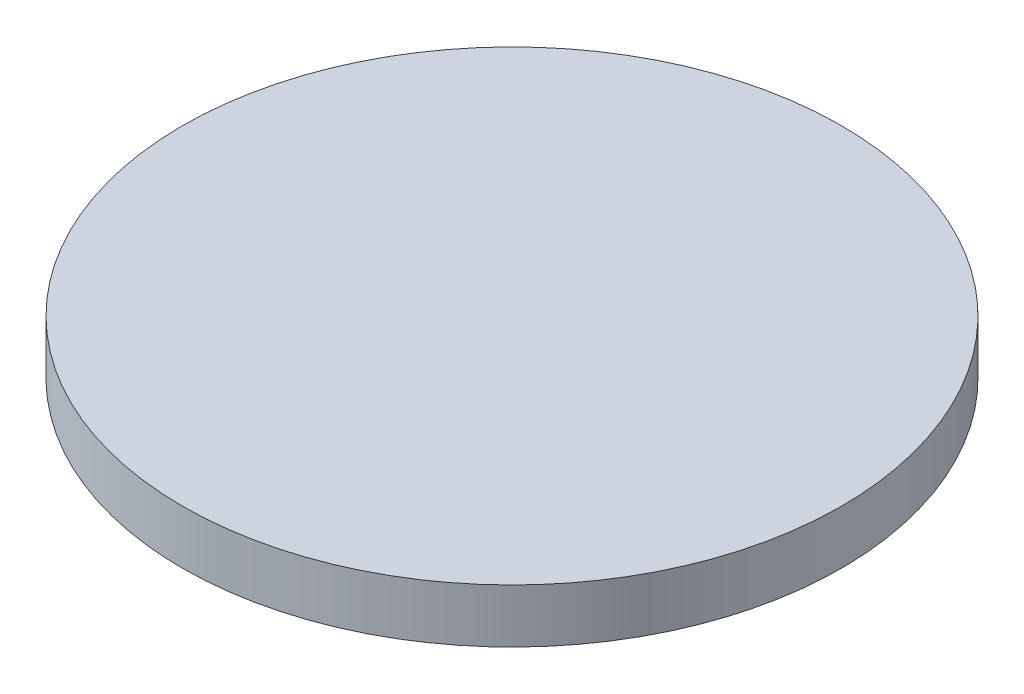
ISO-10303-21;
HEADER;
FILE_DESCRIPTION(('STEP AP214'),'2;1');
FILE_NAME('part.step','',(''),(''),'','','');
FILE_SCHEMA(('AUTOMOTIVE_DESIGN { 1 0 10303 214 1 1 1 1 }'));
ENDSEC;
DATA;
#1=APPLICATION_CONTEXT('core data for automotive mechanical design processes');
#2=APPLICATION_PROTOCOL_DEFINITION('international standard','automotive_design',2000,#1);
#3=PRODUCT_CONTEXT('',#1,'mechanical');
#4=PRODUCT('Part','Part','',(#3));
#5=PRODUCT_RELATED_PRODUCT_CATEGORY('part','',(#4));
#6=PRODUCT_DEFINITION_FORMATION('','',#4);
#7=PRODUCT_DEFINITION_CONTEXT('part definition',#1,'design');
#8=PRODUCT_DEFINITION('design','',#6,#7);
#9=PRODUCT_DEFINITION_SHAPE('','',#8);
#10=(LENGTH_UNIT() NAMED_UNIT(*) SI_UNIT(.MILLI.,.METRE.));
#11=(NAMED_UNIT(*) PLANE_ANGLE_UNIT() SI_UNIT($,.RADIAN.));
#12=(NAMED_UNIT(*) SI_UNIT($,.STERADIAN.) SOLID_ANGLE_UNIT());
#13=UNCERTAINTY_MEASURE_WITH_UNIT(LENGTH_MEASURE(1.E-05),#10,'distance_accuracy_value','');
#14=(GEOMETRIC_REPRESENTATION_CONTEXT(3) GLOBAL_UNCERTAINTY_ASSIGNED_CONTEXT((#13)) GLOBAL_UNIT_ASSIGNED_CONTEXT((#10,
#11,#12)) REPRESENTATION_CONTEXT('',''));
#15=CARTESIAN_POINT('',(0.,0.,0.));
#16=DIRECTION('',(0.,0.,1.));
#17=DIRECTION('',(1.,0.,0.));
#18=AXIS2_PLACEMENT_3D('',#15,#16,#17);
#19=CARTESIAN_POINT('',(24.4976354172611,87.9395406480673,128.323997251865));
#20=CARTESIAN_POINT('',(24.9591019712657,87.9395406480672,128.323997251865));
#21=CARTESIAN_POINT('',(25.8820350792749,87.9395406480672,128.233096274852));
#22=CARTESIAN_POINT('',(27.2132330386579,87.9395406480672,127.829281788648));
#23=CARTESIAN_POINT('',(28.4400721043752,87.9395406480672,127.173522646003));
#24=CARTESIAN_POINT('',(29.5154055391508,87.9395406480672,126.291019303014));
#25=CARTESIAN_POINT('',(30.39790888214,87.9395406480672,125.215685868238));
#26=CARTESIAN_POINT('',(31.0536680247854,87.9395406480672,123.988846802521));
#27=CARTESIAN_POINT('',(31.4574825109891,87.9395406480672,122.657648843138));
#28=CARTESIAN_POINT('',(31.593833976508,87.9395406480672,121.273249181124));
#29=CARTESIAN_POINT('',(31.4574825109891,87.9395406480672,119.88884951911));
#30=CARTESIAN_POINT('',(31.0536680247854,87.9395406480672,118.557651559727));
#31=CARTESIAN_POINT('',(30.39790888214,87.9395406480672,117.33081249401));
#32=CARTESIAN_POINT('',(29.5154055391508,87.9395406480672,116.255479059234));
#33=CARTESIAN_POINT('',(28.4400721043752,87.9395406480672,115.372975716245));
#34=CARTESIAN_POINT('',(27.2132330386579,87.9395406480672,114.7172165736));
#35=CARTESIAN_POINT('',(25.8820350792749,87.9395406480672,114.313402087396));
#36=CARTESIAN_POINT('',(24.4976354172611,87.9395406480672,114.177050621877));
#37=CARTESIAN_POINT('',(23.1132357552472,87.9395406480672,114.313402087396));
#38=CARTESIAN_POINT('',(21.7820377958642,87.9395406480672,114.7172165736));
#39=CARTESIAN_POINT('',(20.5551987301469,87.9395406480672,115.372975716245));
#40=CARTESIAN_POINT('',(19.4798652953713,87.9395406480672,116.255479059234));
#41=CARTESIAN_POINT('',(18.5973619523822,87.9395406480672,117.33081249401));
#42=CARTESIAN_POINT('',(17.9416028097367,87.9395406480672,118.557651559727));
#43=CARTESIAN_POINT('',(17.5377883235331,87.9395406480672,119.88884951911));
#44=CARTESIAN_POINT('',(17.4014368580141,87.9395406480672,121.273249181124));
#45=CARTESIAN_POINT('',(17.5377883235331,87.9395406480672,122.657648843138));
#46=CARTESIAN_POINT('',(17.9416028097368,87.9395406480672,123.988846802521));
#47=CARTESIAN_POINT('',(18.5973619523822,87.9395406480672,125.215685868238));
#48=CARTESIAN_POINT('',(19.4798652953714,87.9395406480672,126.291019303014));
#49=CARTESIAN_POINT('',(20.5551987301469,87.9395406480672,127.173522646003));
#50=CARTESIAN_POINT('',(21.7820377958642,87.9395406480672,127.829281788648));
#51=CARTESIAN_POINT('',(23.1132357552472,87.9395406480672,128.233096274852));
#52=CARTESIAN_POINT('',(24.0361688632565,87.9395406480673,128.323997251865));
#53=CARTESIAN_POINT('',(24.4976354172611,87.9395406480673,128.323997251865));
#54=B_SPLINE_CURVE_WITH_KNOTS('',3,(#19,#20,#21,#22,#23,#24,#25,#26,#27,#28,#29,#30,#31,#32,#33,
#34,#35,#36,#37,#38,#39,#40,#41,#42,#43,#44,#45,#46,#47,#48,#49,#50,#51,#52,#53),.UNSPECIFIED.,
.T.,.F.,(4,1,1,1,1,1,1,1,1,1,1,1,1,1,1,1,1,1,1,1,1,1,1,1,1,1,1,1,1,1,1,1,4),(0.,0.03125,0.0625,
0.09375,0.125,0.15625,0.1875,0.21875,0.25,0.28125,0.3125,0.34375,0.375,0.40625,0.4375,0.46875,
0.5,0.53125,0.5625,0.59375,0.625,0.65625,0.6875,0.71875,0.75,0.78125,0.8125,0.84375,0.875,
0.90625,0.9375,0.96875,1.),.UNSPECIFIED.);
#55=DIRECTION('',(0.,1.,0.));
#56=VECTOR('',#55,1.);
#57=SURFACE_OF_LINEAR_EXTRUSION('',#54,#56);
#58=CARTESIAN_POINT('',(24.4976354172611,87.9395406480672,128.323997251865));
#59=CARTESIAN_POINT('',(24.9591019712657,87.9395406480672,128.323997251865));
#60=CARTESIAN_POINT('',(25.8820350792749,87.9395406480672,128.233096274852));
#61=CARTESIAN_POINT('',(27.2132330386579,87.9395406480672,127.829281788648));
#62=CARTESIAN_POINT('',(28.4400721043752,87.9395406480672,127.173522646003));
#63=CARTESIAN_POINT('',(29.5154055391508,87.9395406480672,126.291019303014));
#64=CARTESIAN_POINT('',(30.39790888214,87.9395406480672,125.215685868238));
#65=CARTESIAN_POINT('',(31.0536680247854,87.9395406480672,123.988846802521));
#66=CARTESIAN_POINT('',(31.4574825109891,87.9395406480672,122.657648843138));
#67=CARTESIAN_POINT('',(31.593833976508,87.9395406480672,121.273249181124));
#68=CARTESIAN_POINT('',(31.4574825109891,87.9395406480672,119.88884951911));
#69=CARTESIAN_POINT('',(31.0536680247854,87.9395406480672,118.557651559727));
#70=CARTESIAN_POINT('',(30.39790888214,87.9395406480672,117.33081249401));
#71=CARTESIAN_POINT('',(29.5154055391508,87.9395406480672,116.255479059234));
#72=CARTESIAN_POINT('',(28.4400721043752,87.9395406480672,115.372975716245));
#73=CARTESIAN_POINT('',(27.2132330386579,87.9395406480672,114.7172165736));
#74=CARTESIAN_POINT('',(25.8820350792749,87.9395406480672,114.313402087396));
#75=CARTESIAN_POINT('',(24.4976354172611,87.9395406480672,114.177050621877));
#76=CARTESIAN_POINT('',(23.1132357552472,87.9395406480672,114.313402087396));
#77=CARTESIAN_POINT('',(21.7820377958642,87.9395406480672,114.7172165736));
#78=CARTESIAN_POINT('',(20.5551987301469,87.9395406480672,115.372975716245));
#79=CARTESIAN_POINT('',(19.4798652953713,87.9395406480672,116.255479059234));
#80=CARTESIAN_POINT('',(18.5973619523822,87.9395406480672,117.33081249401));
#81=CARTESIAN_POINT('',(17.9416028097367,87.9395406480672,118.557651559727));
#82=CARTESIAN_POINT('',(17.5377883235331,87.9395406480672,119.88884951911));
#83=CARTESIAN_POINT('',(17.4014368580141,87.9395406480672,121.273249181124));
#84=CARTESIAN_POINT('',(17.5377883235331,87.9395406480672,122.657648843138));
#85=CARTESIAN_POINT('',(17.9416028097368,87.9395406480672,123.988846802521));
#86=CARTESIAN_POINT('',(18.5973619523822,87.9395406480672,125.215685868238));
#87=CARTESIAN_POINT('',(19.4798652953714,87.9395406480672,126.291019303014));
#88=CARTESIAN_POINT('',(20.5551987301469,87.9395406480672,127.173522646003));
#89=CARTESIAN_POINT('',(21.7820377958642,87.9395406480672,127.829281788648));
#90=CARTESIAN_POINT('',(23.1132357552472,87.9395406480672,128.233096274852));
#91=CARTESIAN_POINT('',(24.0361688632565,87.9395406480672,128.323997251865));
#92=CARTESIAN_POINT('',(24.4976354172611,87.9395406480672,128.323997251865));
#93=B_SPLINE_CURVE_WITH_KNOTS('',3,(#58,#59,#60,#61,#62,#63,#64,#65,#66,#67,#68,#69,#70,#71,#72,
#73,#74,#75,#76,#77,#78,#79,#80,#81,#82,#83,#84,#85,#86,#87,#88,#89,#90,#91,#92),.UNSPECIFIED.,
.T.,.F.,(4,1,1,1,1,1,1,1,1,1,1,1,1,1,1,1,1,1,1,1,1,1,1,1,1,1,1,1,1,1,1,1,4),(0.,0.03125,0.0625,
0.09375,0.125,0.15625,0.1875,0.21875,0.25,0.28125,0.3125,0.34375,0.375,0.40625,0.4375,0.46875,
0.5,0.53125,0.5625,0.59375,0.625,0.65625,0.6875,0.71875,0.75,0.78125,0.8125,0.84375,0.875,
0.90625,0.9375,0.96875,1.),.UNSPECIFIED.);
#94=CARTESIAN_POINT('',(24.4976354172611,87.9395406480672,128.323997251865));
#95=VERTEX_POINT('',#94);
#96=EDGE_CURVE('E9',#95,#95,#93,.T.);
#97=ORIENTED_EDGE('',*,*,#96,.T.);
#98=EDGE_LOOP('',(#97));
#99=FACE_BOUND('',#98,.T.);
#100=CARTESIAN_POINT('',(24.4976354172611,89.0901863363658,128.323997251865));
#101=CARTESIAN_POINT('',(24.382268070367,89.0901863363658,128.323997227935));
#102=CARTESIAN_POINT('',(24.2669015631018,89.0901863363658,128.321156562409));
#103=CARTESIAN_POINT('',(24.0364456375402,89.0901863363657,128.309821255305));
#104=CARTESIAN_POINT('',(23.921356221403,89.0901863363657,128.301326569809));
#105=CARTESIAN_POINT('',(23.6917316887149,89.0901863363657,128.278710530759));
#106=CARTESIAN_POINT('',(23.5771965721639,89.0901863363657,128.264589177205));
#107=CARTESIAN_POINT('',(23.3489571452356,89.0901863363657,128.23074692165));
#108=CARTESIAN_POINT('',(23.2352528284117,89.0901863363657,128.211026063145));
#109=CARTESIAN_POINT('',(23.0089525829597,89.0901863363657,128.166012146331));
#110=CARTESIAN_POINT('',(22.8963566543316,89.0901863363657,128.140719088022));
#111=CARTESIAN_POINT('',(22.6725400325204,89.0901863363657,128.084641801745));
#112=CARTESIAN_POINT('',(22.5613193500268,89.0901863363657,128.053857531124));
#113=CARTESIAN_POINT('',(22.3405192259303,89.0901863363657,127.98687854583));
#114=CARTESIAN_POINT('',(22.2309397843274,89.0901863363657,127.950683831157));
#115=CARTESIAN_POINT('',(22.0136881925052,89.0901863363657,127.872964537219));
#116=CARTESIAN_POINT('',(21.9060160274769,89.0901863363657,127.831439999358));
#117=CARTESIAN_POINT('',(21.6928458621401,89.0901863363657,127.743142025792));
#118=CARTESIAN_POINT('',(21.5873478618317,89.0901863363657,127.696368590087));
#119=CARTESIAN_POINT('',(21.3787719481937,89.0901863363657,127.597704355994));
#120=CARTESIAN_POINT('',(21.2756940536695,89.0901863363657,127.545813517857));
#121=CARTESIAN_POINT('',(21.0722034942003,89.0901863363657,127.437045547761));
#122=CARTESIAN_POINT('',(20.9717908292553,89.0901863363657,127.380168415801));
#123=CARTESIAN_POINT('',(20.7738759478402,89.0901863363657,127.261558793273));
#124=CARTESIAN_POINT('',(20.6763737087682,89.0901863363657,127.199826340424));
#125=CARTESIAN_POINT('',(20.4845256285062,89.0901863363657,127.071637551467));
#126=CARTESIAN_POINT('',(20.390179787316,89.0901863363657,127.005181215359));
#127=CARTESIAN_POINT('',(20.2048600385672,89.0901863363657,126.867721644701));
#128=CARTESIAN_POINT('',(20.113886157207,89.0901863363657,126.796718374834));
#129=CARTESIAN_POINT('',(19.9355251900915,89.0901863363657,126.650341312011));
#130=CARTESIAN_POINT('',(19.8481381043362,89.0901863363657,126.574967519054));
#131=CARTESIAN_POINT('',(19.6771656913242,89.0901863363657,126.420025669217));
#132=CARTESIAN_POINT('',(19.5935803345415,89.0901863363657,126.340457644922));
#133=CARTESIAN_POINT('',(19.4304269534634,89.0901863363657,126.177304263844));
#134=CARTESIAN_POINT('',(19.350858929168,89.0901863363657,126.093718907061));
#135=CARTESIAN_POINT('',(19.1959170793312,89.0901863363657,125.922746494049));
#136=CARTESIAN_POINT('',(19.1205432863745,89.0901863363657,125.835359408294));
#137=CARTESIAN_POINT('',(18.9741662235511,89.0901863363657,125.656998441178));
#138=CARTESIAN_POINT('',(18.9031629536844,89.0901863363657,125.566024559818));
#139=CARTESIAN_POINT('',(18.7657033830257,89.0901863363657,125.380704811069));
#140=CARTESIAN_POINT('',(18.6992470469179,89.0901863363657,125.286358969879));
#141=CARTESIAN_POINT('',(18.571058257961,89.0901863363657,125.094510889617));
#142=CARTESIAN_POINT('',(18.509325805112,89.0901863363657,124.997008650545));
#143=CARTESIAN_POINT('',(18.3907161825839,89.0901863363657,124.79909376913));
#144=CARTESIAN_POINT('',(18.3338390506239,89.0901863363657,124.698681104184));
#145=CARTESIAN_POINT('',(18.2250710805278,89.0901863363657,124.495190544717));
#146=CARTESIAN_POINT('',(18.1731802423916,89.0901863363657,124.392112650195));
#147=CARTESIAN_POINT('',(18.0745160082983,89.0901863363657,124.18353673655));
#148=CARTESIAN_POINT('',(18.0277425725929,89.0901863363657,124.078038736232));
#149=CARTESIAN_POINT('',(17.9394445990278,89.0901863363657,123.864868570921));
#150=CARTESIAN_POINT('',(17.8979200611681,89.0901863363657,123.757196405928));
#151=CARTESIAN_POINT('',(17.8202007672255,89.0901863363657,123.53994481401));
#152=CARTESIAN_POINT('',(17.7840060525463,89.0901863363657,123.430365372275));
#153=CARTESIAN_POINT('',(17.7170270672704,89.0901863363657,123.209565248538));
#154=CARTESIAN_POINT('',(17.6862427966737,89.0901863363657,123.098344566534));
#155=CARTESIAN_POINT('',(17.6301655103306,89.0901863363657,122.874527943384));
#156=CARTESIAN_POINT('',(17.6048724519309,89.0901863363657,122.761932012927));
#157=CARTESIAN_POINT('',(17.5598585353635,89.0901863363657,122.535631772472));
#158=CARTESIAN_POINT('',(17.5401376771958,89.0901863363657,122.421927462475));
#159=CARTESIAN_POINT('',(17.5062954207195,89.0901863363657,122.193688016895));
#160=CARTESIAN_POINT('',(17.492174065908,89.0901863363657,122.079152874866));
#161=CARTESIAN_POINT('',(17.4695580302943,89.0901863363657,121.849528411787));
#162=CARTESIAN_POINT('',(17.461063349492,89.0901863363657,121.734439090738));
#163=CARTESIAN_POINT('',(17.4497280295646,89.0901863363657,121.503982905392));
#164=CARTESIAN_POINT('',(17.4468873465205,89.0901863363657,121.388616043258));
#165=CARTESIAN_POINT('',(17.4468873465205,89.0901863363657,121.15788231899));
#166=CARTESIAN_POINT('',(17.4497280295646,89.0901863363657,121.042515456856));
#167=CARTESIAN_POINT('',(17.461063349492,89.0901863363657,120.812059271511));
#168=CARTESIAN_POINT('',(17.4695580302943,89.0901863363657,120.696969950461));
#169=CARTESIAN_POINT('',(17.492174065908,89.0901863363657,120.467345487383));
#170=CARTESIAN_POINT('',(17.5062954207195,89.0901863363657,120.352810345353));
#171=CARTESIAN_POINT('',(17.5401376771958,89.0901863363657,120.124570899773));
#172=CARTESIAN_POINT('',(17.5598585353635,89.0901863363657,120.010866589776));
#173=CARTESIAN_POINT('',(17.6048724519309,89.0901863363657,119.784566349322));
#174=CARTESIAN_POINT('',(17.6301655103306,89.0901863363657,119.671970418864));
#175=CARTESIAN_POINT('',(17.6862427966737,89.0901863363657,119.448153795714));
#176=CARTESIAN_POINT('',(17.7170270672704,89.0901863363657,119.33693311371));
#177=CARTESIAN_POINT('',(17.7840060525463,89.0901863363657,119.116132989973));
#178=CARTESIAN_POINT('',(17.8202007672255,89.0901863363657,119.006553548239));
#179=CARTESIAN_POINT('',(17.8979200611681,89.0901863363657,118.78930195632));
#180=CARTESIAN_POINT('',(17.9394445990278,89.0901863363657,118.681629791327));
#181=CARTESIAN_POINT('',(18.0277425725929,89.0901863363657,118.468459626016));
#182=CARTESIAN_POINT('',(18.0745160082984,89.0901863363657,118.362961625698));
#183=CARTESIAN_POINT('',(18.1731802423916,89.0901863363657,118.154385712053));
#184=CARTESIAN_POINT('',(18.2250710805277,89.0901863363657,118.051307817532));
#185=CARTESIAN_POINT('',(18.3338390506239,89.0901863363657,117.847817258064));
#186=CARTESIAN_POINT('',(18.3907161825839,89.0901863363657,117.747404593119));
#187=CARTESIAN_POINT('',(18.509325805112,89.0901863363657,117.549489711703));
#188=CARTESIAN_POINT('',(18.571058257961,89.0901863363657,117.451987472631));
#189=CARTESIAN_POINT('',(18.6992470469179,89.0901863363657,117.260139392369));
#190=CARTESIAN_POINT('',(18.7657033830257,89.0901863363657,117.165793551179));
#191=CARTESIAN_POINT('',(18.9031629536844,89.0901863363657,116.98047380243));
#192=CARTESIAN_POINT('',(18.9741662235511,89.0901863363657,116.88949992107));
#193=CARTESIAN_POINT('',(19.1205432863745,89.0901863363657,116.711138953955));
#194=CARTESIAN_POINT('',(19.1959170793312,89.0901863363657,116.623751868199));
#195=CARTESIAN_POINT('',(19.3508589291681,89.0901863363657,116.452779455187));
#196=CARTESIAN_POINT('',(19.4304269534634,89.0901863363657,116.369194098404));
#197=CARTESIAN_POINT('',(19.5935803345414,89.0901863363657,116.206040717326));
#198=CARTESIAN_POINT('',(19.6771656913242,89.0901863363657,116.126472693031));
#199=CARTESIAN_POINT('',(19.8481381043362,89.0901863363657,115.971530843194));
#200=CARTESIAN_POINT('',(19.9355251900915,89.0901863363657,115.896157050237));
#201=CARTESIAN_POINT('',(20.113886157207,89.0901863363657,115.749779987414));
#202=CARTESIAN_POINT('',(20.2048600385672,89.0901863363657,115.678776717547));
#203=CARTESIAN_POINT('',(20.390179787316,89.0901863363657,115.541317146889));
#204=CARTESIAN_POINT('',(20.4845256285062,89.0901863363657,115.474860810781));
#205=CARTESIAN_POINT('',(20.6763737087682,89.0901863363657,115.346672021824));
#206=CARTESIAN_POINT('',(20.7738759478399,89.0901863363657,115.284939568975));
#207=CARTESIAN_POINT('',(20.9717908292556,89.0901863363657,115.166329946447));
#208=CARTESIAN_POINT('',(21.0722034942012,89.0901863363657,115.109452814487));
#209=CARTESIAN_POINT('',(21.2756940536686,89.0901863363657,115.000684844391));
#210=CARTESIAN_POINT('',(21.3787719481902,89.0901863363657,114.948794006255));
#211=CARTESIAN_POINT('',(21.5873478618351,89.0901863363657,114.850129772161));
#212=CARTESIAN_POINT('',(21.692845862153,89.0901863363657,114.803356336456));
#213=CARTESIAN_POINT('',(21.906016027464,89.0901863363657,114.715058362891));
#214=CARTESIAN_POINT('',(22.0136881924571,89.0901863363657,114.673533825031));
#215=CARTESIAN_POINT('',(22.2309397843755,89.0901863363657,114.595814531089));
#216=CARTESIAN_POINT('',(22.3405192261097,89.0901863363657,114.559619816409));
#217=CARTESIAN_POINT('',(22.5613193498474,89.0901863363657,114.492640831133));
#218=CARTESIAN_POINT('',(22.6725400318509,89.0901863363657,114.461856560537));
#219=CARTESIAN_POINT('',(22.8963566550012,89.0901863363657,114.405779274194));
#220=CARTESIAN_POINT('',(23.0089525854585,89.0901863363657,114.380486215794));
#221=CARTESIAN_POINT('',(23.2352528259129,89.0901863363657,114.335472299227));
#222=CARTESIAN_POINT('',(23.3489571359099,89.0901863363657,114.315751441059));
#223=CARTESIAN_POINT('',(23.5771965814897,89.0901863363657,114.281909184583));
#224=CARTESIAN_POINT('',(23.6917317235195,89.0901863363657,114.267787829771));
#225=CARTESIAN_POINT('',(23.9213561865984,89.0901863363657,114.245171794157));
#226=CARTESIAN_POINT('',(24.0364455076476,89.0901863363657,114.236677113355));
#227=CARTESIAN_POINT('',(24.2669016929934,89.0901863363657,114.225341793428));
#228=CARTESIAN_POINT('',(24.3822685551272,89.0901863363657,114.222501110383));
#229=CARTESIAN_POINT('',(24.6130022793949,89.0901863363657,114.222501110383));
#230=CARTESIAN_POINT('',(24.7283691415287,89.0901863363657,114.225341793428));
#231=CARTESIAN_POINT('',(24.9588253268746,89.0901863363657,114.236677113355));
#232=CARTESIAN_POINT('',(25.0739146479237,89.0901863363658,114.245171794157));
#233=CARTESIAN_POINT('',(25.3035391110027,89.0901863363658,114.267787829771));
#234=CARTESIAN_POINT('',(25.4180742530324,89.0901863363658,114.281909184583));
#235=CARTESIAN_POINT('',(25.6463136986123,89.0901863363658,114.315751441059));
#236=CARTESIAN_POINT('',(25.7600180086093,89.0901863363657,114.335472299227));
#237=CARTESIAN_POINT('',(25.9863182490636,89.0901863363657,114.380486215794));
#238=CARTESIAN_POINT('',(26.098914179521,89.0901863363657,114.405779274194));
#239=CARTESIAN_POINT('',(26.3227308026713,89.0901863363657,114.461856560537));
#240=CARTESIAN_POINT('',(26.4339514846747,89.0901863363657,114.492640831133));
#241=CARTESIAN_POINT('',(26.6547516084124,89.0901863363657,114.559619816409));
#242=CARTESIAN_POINT('',(26.7643310501466,89.0901863363657,114.595814531089));
#243=CARTESIAN_POINT('',(26.981582642065,89.0901863363657,114.673533825031));
#244=CARTESIAN_POINT('',(27.0892548070581,89.0901863363657,114.715058362891));
#245=CARTESIAN_POINT('',(27.3024249723691,89.0901863363657,114.803356336456));
#246=CARTESIAN_POINT('',(27.407922972687,89.0901863363657,114.850129772161));
#247=CARTESIAN_POINT('',(27.6164988863319,89.0901863363657,114.948794006255));
#248=CARTESIAN_POINT('',(27.7195767808536,89.0901863363657,115.000684844391));
#249=CARTESIAN_POINT('',(27.9230673403209,89.0901863363657,115.109452814487));
#250=CARTESIAN_POINT('',(28.0234800052666,89.0901863363657,115.166329946447));
#251=CARTESIAN_POINT('',(28.2213948866822,89.0901863363657,115.284939568975));
#252=CARTESIAN_POINT('',(28.318897125754,89.0901863363657,115.346672021824));
#253=CARTESIAN_POINT('',(28.5107452060159,89.0901863363657,115.474860810781));
#254=CARTESIAN_POINT('',(28.6050910472061,89.0901863363657,115.541317146889));
#255=CARTESIAN_POINT('',(28.790410795955,89.0901863363657,115.678776717547));
#256=CARTESIAN_POINT('',(28.8813846773151,89.0901863363657,115.749779987414));
#257=CARTESIAN_POINT('',(29.0597456444306,89.0901863363657,115.896157050237));
#258=CARTESIAN_POINT('',(29.1471327301859,89.0901863363657,115.971530843194));
#259=CARTESIAN_POINT('',(29.3181051431979,89.0901863363657,116.126472693031));
#260=CARTESIAN_POINT('',(29.4016904999807,89.0901863363657,116.206040717326));
#261=CARTESIAN_POINT('',(29.5648438810588,89.0901863363657,116.369194098404));
#262=CARTESIAN_POINT('',(29.6444119053541,89.0901863363657,116.452779455187));
#263=CARTESIAN_POINT('',(29.799353755191,89.0901863363657,116.623751868199));
#264=CARTESIAN_POINT('',(29.8747275481477,89.0901863363657,116.711138953955));
#265=CARTESIAN_POINT('',(30.021104610971,89.0901863363657,116.88949992107));
#266=CARTESIAN_POINT('',(30.0921078808377,89.0901863363657,116.98047380243));
#267=CARTESIAN_POINT('',(30.2295674514964,89.0901863363657,117.165793551179));
#268=CARTESIAN_POINT('',(30.2960237876043,89.0901863363657,117.260139392369));
#269=CARTESIAN_POINT('',(30.4242125765611,89.0901863363657,117.451987472631));
#270=CARTESIAN_POINT('',(30.4859450294102,89.0901863363657,117.549489711703));
#271=CARTESIAN_POINT('',(30.6045546519382,89.0901863363657,117.747404593119));
#272=CARTESIAN_POINT('',(30.6614317838983,89.0901863363657,117.847817258064));
#273=CARTESIAN_POINT('',(30.7701997539944,89.0901863363657,118.051307817532));
#274=CARTESIAN_POINT('',(30.8220905921305,89.0901863363657,118.154385712053));
#275=CARTESIAN_POINT('',(30.9207548262238,89.0901863363657,118.362961625698));
#276=CARTESIAN_POINT('',(30.9675282619292,89.0901863363657,118.468459626016));
#277=CARTESIAN_POINT('',(31.0558262354944,89.0901863363657,118.681629791327));
#278=CARTESIAN_POINT('',(31.0973507733541,89.0901863363657,118.78930195632));
#279=CARTESIAN_POINT('',(31.1750700672966,89.0901863363657,119.006553548239));
#280=CARTESIAN_POINT('',(31.2112647819758,89.0901863363657,119.116132989973));
#281=CARTESIAN_POINT('',(31.2782437672517,89.0901863363657,119.33693311371));
#282=CARTESIAN_POINT('',(31.3090280378485,89.0901863363657,119.448153795714));
#283=CARTESIAN_POINT('',(31.3651053241916,89.0901863363657,119.671970418864));
#284=CARTESIAN_POINT('',(31.3903983825913,89.0901863363657,119.784566349322));
#285=CARTESIAN_POINT('',(31.4354122991586,89.0901863363657,120.010866589776));
#286=CARTESIAN_POINT('',(31.4551331573263,89.0901863363657,120.124570899773));
#287=CARTESIAN_POINT('',(31.4889754138026,89.0901863363657,120.352810345353));
#288=CARTESIAN_POINT('',(31.5030967686141,89.0901863363657,120.467345487382));
#289=CARTESIAN_POINT('',(31.5257128042279,89.0901863363657,120.696969950461));
#290=CARTESIAN_POINT('',(31.5342074850302,89.0901863363657,120.812059271511));
#291=CARTESIAN_POINT('',(31.5455428049575,89.0901863363657,121.042515456856));
#292=CARTESIAN_POINT('',(31.5483834880017,89.0901863363657,121.15788231899));
#293=CARTESIAN_POINT('',(31.5483834880017,89.0901863363657,121.388616043258));
#294=CARTESIAN_POINT('',(31.5455428049575,89.0901863363657,121.503982905392));
#295=CARTESIAN_POINT('',(31.5342074850302,89.0901863363657,121.734439090738));
#296=CARTESIAN_POINT('',(31.5257128042279,89.0901863363657,121.849528411787));
#297=CARTESIAN_POINT('',(31.5030967686141,89.0901863363657,122.079152874866));
#298=CARTESIAN_POINT('',(31.4889754138026,89.0901863363657,122.193688016895));
#299=CARTESIAN_POINT('',(31.4551331573263,89.0901863363657,122.421927462475));
#300=CARTESIAN_POINT('',(31.4354122991586,89.0901863363657,122.535631772472));
#301=CARTESIAN_POINT('',(31.3903983825913,89.0901863363657,122.761932012927));
#302=CARTESIAN_POINT('',(31.3651053241916,89.0901863363657,122.874527943384));
#303=CARTESIAN_POINT('',(31.3090280378485,89.0901863363657,123.098344566534));
#304=CARTESIAN_POINT('',(31.2782437672517,89.0901863363657,123.209565248538));
#305=CARTESIAN_POINT('',(31.2112647819758,89.0901863363657,123.430365372275));
#306=CARTESIAN_POINT('',(31.1750700672966,89.0901863363657,123.53994481401));
#307=CARTESIAN_POINT('',(31.0973507733541,89.0901863363657,123.757196405928));
#308=CARTESIAN_POINT('',(31.0558262354944,89.0901863363657,123.864868570921));
#309=CARTESIAN_POINT('',(30.9675282619292,89.0901863363657,124.078038736232));
#310=CARTESIAN_POINT('',(30.9207548262238,89.0901863363657,124.18353673655));
#311=CARTESIAN_POINT('',(30.8220905921305,89.0901863363657,124.392112650195));
#312=CARTESIAN_POINT('',(30.7701997539944,89.0901863363657,124.495190544717));
#313=CARTESIAN_POINT('',(30.6614317838983,89.0901863363657,124.698681104184));
#314=CARTESIAN_POINT('',(30.6045546519382,89.0901863363657,124.79909376913));
#315=CARTESIAN_POINT('',(30.4859450294102,89.0901863363657,124.997008650545));
#316=CARTESIAN_POINT('',(30.4242125765611,89.0901863363657,125.094510889617));
#317=CARTESIAN_POINT('',(30.2960237876043,89.0901863363657,125.286358969879));
#318=CARTESIAN_POINT('',(30.2295674514964,89.0901863363657,125.380704811069));
#319=CARTESIAN_POINT('',(30.0921078808377,89.0901863363657,125.566024559818));
#320=CARTESIAN_POINT('',(30.021104610971,89.0901863363657,125.656998441178));
#321=CARTESIAN_POINT('',(29.8747275481477,89.0901863363657,125.835359408294));
#322=CARTESIAN_POINT('',(29.799353755191,89.0901863363657,125.922746494049));
#323=CARTESIAN_POINT('',(29.6444119053541,89.0901863363657,126.093718907061));
#324=CARTESIAN_POINT('',(29.5648438810588,89.0901863363657,126.177304263844));
#325=CARTESIAN_POINT('',(29.4016904999807,89.0901863363657,126.340457644922));
#326=CARTESIAN_POINT('',(29.3181051431979,89.0901863363657,126.420025669217));
#327=CARTESIAN_POINT('',(29.1471327301859,89.0901863363657,126.574967519054));
#328=CARTESIAN_POINT('',(29.0597456444306,89.0901863363657,126.650341312011));
#329=CARTESIAN_POINT('',(28.8813846773151,89.0901863363657,126.796718374834));
#330=CARTESIAN_POINT('',(28.7904107959549,89.0901863363657,126.867721644701));
#331=CARTESIAN_POINT('',(28.6050910472061,89.0901863363657,127.005181215359));
#332=CARTESIAN_POINT('',(28.510745206016,89.0901863363657,127.071637551467));
#333=CARTESIAN_POINT('',(28.3188971257539,89.0901863363657,127.199826340424));
#334=CARTESIAN_POINT('',(28.221394886682,89.0901863363657,127.261558793273));
#335=CARTESIAN_POINT('',(28.0234800052668,89.0901863363657,127.380168415801));
#336=CARTESIAN_POINT('',(27.9230673403218,89.0901863363657,127.437045547761));
#337=CARTESIAN_POINT('',(27.7195767808527,89.0901863363657,127.545813517857));
#338=CARTESIAN_POINT('',(27.6164988863285,89.0901863363657,127.597704355994));
#339=CARTESIAN_POINT('',(27.4079229726905,89.0901863363657,127.696368590087));
#340=CARTESIAN_POINT('',(27.302424972382,89.0901863363657,127.743142025792));
#341=CARTESIAN_POINT('',(27.0892548070453,89.0901863363657,127.831439999358));
#342=CARTESIAN_POINT('',(26.981582642017,89.0901863363657,127.872964537219));
#343=CARTESIAN_POINT('',(26.7643310501947,89.0901863363657,127.950683831157));
#344=CARTESIAN_POINT('',(26.6547516085918,89.0901863363657,127.98687854583));
#345=CARTESIAN_POINT('',(26.4339514844953,89.0901863363657,128.053857531124));
#346=CARTESIAN_POINT('',(26.3227308020017,89.0901863363657,128.084641801745));
#347=CARTESIAN_POINT('',(26.0989141801905,89.0901863363657,128.140719088022));
#348=CARTESIAN_POINT('',(25.9863182515625,89.0901863363657,128.166012146331));
#349=CARTESIAN_POINT('',(25.7600180061105,89.0901863363657,128.211026063145));
#350=CARTESIAN_POINT('',(25.6463136892865,89.0901863363657,128.23074692165));
#351=CARTESIAN_POINT('',(25.4180742623583,89.0901863363657,128.264589177205));
#352=CARTESIAN_POINT('',(25.3035391458073,89.0901863363657,128.278710530759));
#353=CARTESIAN_POINT('',(25.0739146131191,89.0901863363657,128.301326569809));
#354=CARTESIAN_POINT('',(24.958825196982,89.0901863363657,128.309821255305));
#355=CARTESIAN_POINT('',(24.7283692714203,89.0901863363657,128.321156562409));
#356=CARTESIAN_POINT('',(24.6130027641551,89.0901863363657,128.323997227935));
#357=CARTESIAN_POINT('',(24.4976354172611,89.0901863363658,128.323997251865));
#358=B_SPLINE_CURVE_WITH_KNOTS('',3,(#100,#101,#102,#103,#104,#105,#106,#107,#108,#109,#110,
#111,#112,#113,#114,#115,#116,#117,#118,#119,#120,#121,#122,#123,#124,#125,#126,#127,#128,#129,
#130,#131,#132,#133,#134,#135,#136,#137,#138,#139,#140,#141,#142,#143,#144,#145,#146,#147,#148,
#149,#150,#151,#152,#153,#154,#155,#156,#157,#158,#159,#160,#161,#162,#163,#164,#165,#166,#167,
#168,#169,#170,#171,#172,#173,#174,#175,#176,#177,#178,#179,#180,#181,#182,#183,#184,#185,#186,
#187,#188,#189,#190,#191,#192,#193,#194,#195,#196,#197,#198,#199,#200,#201,#202,#203,#204,#205,
#206,#207,#208,#209,#210,#211,#212,#213,#214,#215,#216,#217,#218,#219,#220,#221,#222,#223,#224,
#225,#226,#227,#228,#229,#230,#231,#232,#233,#234,#235,#236,#237,#238,#239,#240,#241,#242,#243,
#244,#245,#246,#247,#248,#249,#250,#251,#252,#253,#254,#255,#256,#257,#258,#259,#260,#261,#262,
#263,#264,#265,#266,#267,#268,#269,#270,#271,#272,#273,#274,#275,#276,#277,#278,#279,#280,#281,
#282,#283,#284,#285,#286,#287,#288,#289,#290,#291,#292,#293,#294,#295,#296,#297,#298,#299,#300,
#301,#302,#303,#304,#305,#306,#307,#308,#309,#310,#311,#312,#313,#314,#315,#316,#317,#318,#319,
#320,#321,#322,#323,#324,#325,#326,#327,#328,#329,#330,#331,#332,#333,#334,#335,#336,#337,#338,
#339,#340,#341,#342,#343,#344,#345,#346,#347,#348,#349,#350,#351,#352,#353,#354,#355,#356,#357),
.UNSPECIFIED.,.F.,.F.,(4,2,2,2,2,2,2,2,2,2,2,2,2,2,2,2,2,2,2,2,2,2,2,2,2,2,2,2,2,2,2,2,2,2,2,2,
2,2,2,2,2,2,2,2,2,2,2,2,2,2,2,2,2,2,2,2,2,2,2,2,2,2,2,2,2,2,2,2,2,2,2,2,2,2,2,2,2,2,2,2,2,2,2,2,
2,2,2,2,2,2,2,2,2,2,2,2,2,2,2,2,2,2,2,2,2,2,2,2,2,2,2,2,2,2,2,2,2,2,2,2,2,2,2,2,2,2,2,2,4),(0.,
0.346065977300947,0.692134642803626,1.03820330830631,1.38426928560726,1.73033526290821,
2.07640392841089,2.42247259391357,2.76853857121451,3.11460454851548,3.46067321401813,
3.80674187952081,4.15280785682176,4.4988738341227,4.84494249962539,5.19101116512807,
5.537077142429,5.88314311972997,6.22921178523264,6.57528045073531,6.92134642803626,
7.26741240533719,7.61348107083987,7.95954973634253,8.30561571364349,8.65168169094444,
8.99775035644712,9.3438190219498,9.68988499925076,10.0359509765517,10.3820196420544,
10.7280883075571,11.074154284858,11.420220262159,11.7662889276616,12.1123575931643,
12.4584235704653,12.8044895477662,13.1505582132689,13.4966268787716,13.8426928560725,
14.1887588333735,14.5348274988761,14.8808961643788,15.2269621416797,15.5730281189807,
15.9190967844834,16.265165449986,16.611231427287,16.9572974045879,17.3033660700906,
17.6494347355933,17.9955007128942,18.3415666901952,18.6876353556979,19.0337040212005,
19.3797699985015,19.7258359758024,20.0719046413051,20.4179733068078,20.7640392841088,
21.1101052614097,21.4561739269124,21.8022425924151,22.148308569716,22.4943745470169,
22.8404432125196,23.1865118780223,23.5325778553232,23.8786438326242,24.2247124981269,
24.5707811636295,24.9168471409305,25.2629131182314,25.6089817837341,25.9550504492368,
26.3011164265377,26.6471824038387,26.9932510693414,27.339319734844,27.685385712145,
28.0314516894459,28.3775203549486,28.7235890204513,29.0696549977522,29.4157209750532,
29.7617896405559,30.1078583060586,30.4539242833595,30.7999902606605,31.1460589261631,
31.4921275916658,31.8381935689667,32.1842595462677,32.5303282117704,32.876396877273,
33.222462854574,33.5685288318749,33.9145974973776,34.2606661628803,34.6067321401812,
34.9527981174822,35.2988667829849,35.6449354484876,35.9910014257885,36.3370674030895,
36.6831360685921,37.0292047340948,37.3752707113957,37.7213366886967,38.0674053541994,
38.413474019702,38.759539997003,39.1056059743039,39.4516746398066,39.7977433053093,
40.1438092826102,40.4898752599112,40.8359439254139,41.1820125909165,41.5280785682175,
41.8741445455184,42.2202132110211,42.5662818765238,42.9123478538247,43.2584138311257,
43.6044824966284,43.950551162131,44.296617139432),.UNSPECIFIED.);
#359=CARTESIAN_POINT('',(24.4976354172611,89.0901863363658,128.323997251865));
#360=VERTEX_POINT('',#359);
#361=EDGE_CURVE('E24',#360,#360,#358,.F.);
#362=ORIENTED_EDGE('',*,*,#361,.F.);
#363=EDGE_LOOP('',(#362));
#364=FACE_BOUND('',#363,.T.);
#365=ADVANCED_FACE('F14',(#99,#364),#57,.T.);
#366=CARTESIAN_POINT('',(24.4976354172611,87.9395406480672,114.415249181124));
#367=DIRECTION('',(0.,1.,0.));
#368=DIRECTION('',(-1.,0.,0.));
#369=AXIS2_PLACEMENT_3D('',#366,#367,#368);
#370=PLANE('',#369);
#371=ORIENTED_EDGE('',*,*,#96,.F.);
#372=EDGE_LOOP('',(#371));
#373=FACE_BOUND('',#372,.T.);
#374=ADVANCED_FACE('F62',(#373),#370,.F.);
#375=CARTESIAN_POINT('',(24.4976354172611,89.0901863363658,114.415249181124));
#376=DIRECTION('',(0.,1.,0.));
#377=DIRECTION('',(-1.,0.,0.));
#378=AXIS2_PLACEMENT_3D('',#375,#376,#377);
#379=PLANE('',#378);
#380=ORIENTED_EDGE('',*,*,#361,.T.);
#381=EDGE_LOOP('',(#380));
#382=FACE_BOUND('',#381,.T.);
#383=ADVANCED_FACE('F31',(#382),#379,.T.);
#384=CLOSED_SHELL('',(#365,#374,#383));
#385=MANIFOLD_SOLID_BREP('B1',#384);
#386=ADVANCED_BREP_SHAPE_REPRESENTATION('',(#18,#385),#14);
#387=SHAPE_DEFINITION_REPRESENTATION(#9,#386);
ENDSEC;
END-ISO-10303-21;
